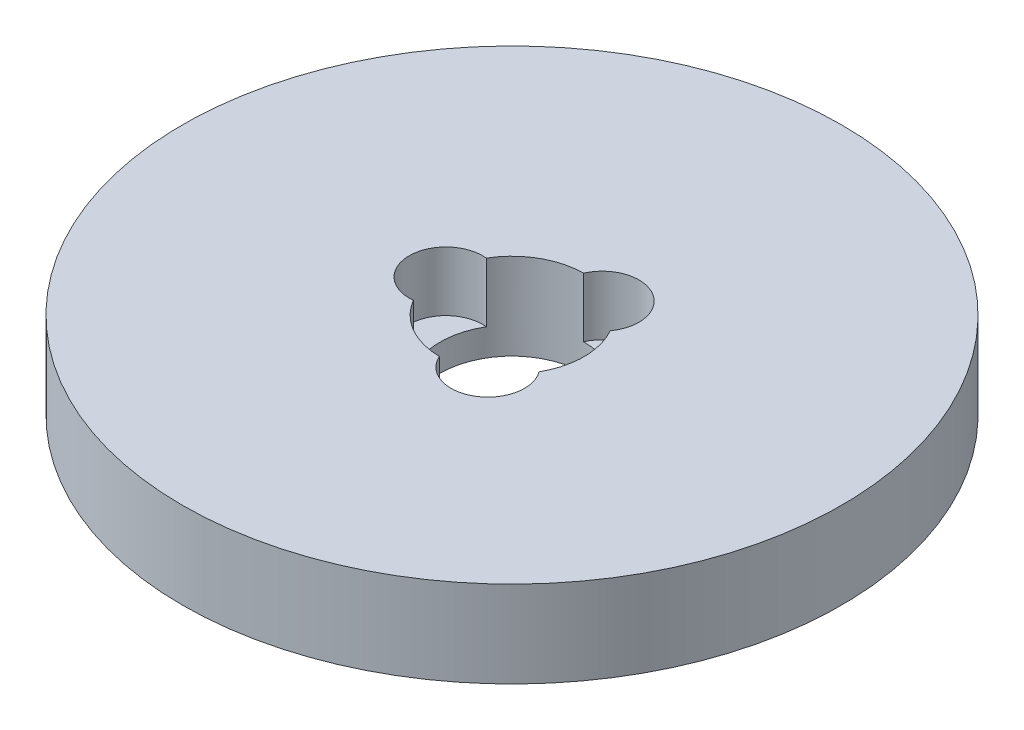
ISO-10303-21;
HEADER;
FILE_DESCRIPTION(('STEP AP214'),'2;1');
FILE_NAME('part.step','',(''),(''),'','','');
FILE_SCHEMA(('AUTOMOTIVE_DESIGN { 1 0 10303 214 1 1 1 1 }'));
ENDSEC;
DATA;
#1=APPLICATION_CONTEXT('core data for automotive mechanical design processes');
#2=APPLICATION_PROTOCOL_DEFINITION('international standard','automotive_design',2000,#1);
#3=PRODUCT_CONTEXT('',#1,'mechanical');
#4=PRODUCT('Part','Part','',(#3));
#5=PRODUCT_RELATED_PRODUCT_CATEGORY('part','',(#4));
#6=PRODUCT_DEFINITION_FORMATION('','',#4);
#7=PRODUCT_DEFINITION_CONTEXT('part definition',#1,'design');
#8=PRODUCT_DEFINITION('design','',#6,#7);
#9=PRODUCT_DEFINITION_SHAPE('','',#8);
#10=(LENGTH_UNIT() NAMED_UNIT(*) SI_UNIT(.MILLI.,.METRE.));
#11=(NAMED_UNIT(*) PLANE_ANGLE_UNIT() SI_UNIT($,.RADIAN.));
#12=(NAMED_UNIT(*) SI_UNIT($,.STERADIAN.) SOLID_ANGLE_UNIT());
#13=UNCERTAINTY_MEASURE_WITH_UNIT(LENGTH_MEASURE(1.E-05),#10,'distance_accuracy_value','');
#14=(GEOMETRIC_REPRESENTATION_CONTEXT(3) GLOBAL_UNCERTAINTY_ASSIGNED_CONTEXT((#13)) GLOBAL_UNIT_ASSIGNED_CONTEXT((#10,
#11,#12)) REPRESENTATION_CONTEXT('',''));
#15=CARTESIAN_POINT('',(0.,0.,0.));
#16=DIRECTION('',(0.,0.,1.));
#17=DIRECTION('',(1.,0.,0.));
#18=AXIS2_PLACEMENT_3D('',#15,#16,#17);
#19=CARTESIAN_POINT('',(0.,21.,0.));
#20=DIRECTION('',(0.,-1.,0.));
#21=DIRECTION('',(0.,0.,-1.));
#22=AXIS2_PLACEMENT_3D('',#19,#20,#21);
#23=CYLINDRICAL_SURFACE('',#22,80.);
#24=CARTESIAN_POINT('',(0.,21.,0.));
#25=DIRECTION('',(0.,1.,0.));
#26=DIRECTION('',(0.,0.,1.));
#27=AXIS2_PLACEMENT_3D('',#24,#25,#26);
#28=CIRCLE('',#27,80.);
#29=CARTESIAN_POINT('',(0.,21.,-80.));
#30=VERTEX_POINT('',#29);
#31=EDGE_CURVE('E126',#30,#30,#28,.T.);
#32=CARTESIAN_POINT('',(0.,0.,0.));
#33=DIRECTION('',(0.,1.,0.));
#34=DIRECTION('',(0.,0.,1.));
#35=AXIS2_PLACEMENT_3D('',#32,#33,#34);
#36=CIRCLE('',#35,80.);
#37=CARTESIAN_POINT('',(0.,0.,-80.));
#38=VERTEX_POINT('',#37);
#39=EDGE_CURVE('E124',#38,#38,#36,.T.);
#40=CARTESIAN_POINT('',(0.,21.,-80.));
#41=CARTESIAN_POINT('',(0.,20.78125,-80.));
#42=CARTESIAN_POINT('',(0.,20.5625,-80.));
#43=CARTESIAN_POINT('',(0.,20.125,-80.));
#44=CARTESIAN_POINT('',(0.,19.90625,-80.));
#45=CARTESIAN_POINT('',(0.,19.46875,-80.));
#46=CARTESIAN_POINT('',(0.,19.25,-80.));
#47=CARTESIAN_POINT('',(0.,18.8125,-80.));
#48=CARTESIAN_POINT('',(0.,18.59375,-80.));
#49=CARTESIAN_POINT('',(0.,18.15625,-80.));
#50=CARTESIAN_POINT('',(0.,17.9375,-80.));
#51=CARTESIAN_POINT('',(0.,17.5,-80.));
#52=CARTESIAN_POINT('',(0.,17.28125,-80.));
#53=CARTESIAN_POINT('',(0.,16.84375,-80.));
#54=CARTESIAN_POINT('',(0.,16.625,-80.));
#55=CARTESIAN_POINT('',(0.,16.1875,-80.));
#56=CARTESIAN_POINT('',(0.,15.96875,-80.));
#57=CARTESIAN_POINT('',(0.,15.53125,-80.));
#58=CARTESIAN_POINT('',(0.,15.3125,-80.));
#59=CARTESIAN_POINT('',(0.,14.875,-80.));
#60=CARTESIAN_POINT('',(0.,14.65625,-80.));
#61=CARTESIAN_POINT('',(0.,14.21875,-80.));
#62=CARTESIAN_POINT('',(0.,14.,-80.));
#63=CARTESIAN_POINT('',(0.,13.5625,-80.));
#64=CARTESIAN_POINT('',(0.,13.34375,-80.));
#65=CARTESIAN_POINT('',(0.,12.90625,-80.));
#66=CARTESIAN_POINT('',(0.,12.6875,-80.));
#67=CARTESIAN_POINT('',(0.,12.25,-80.));
#68=CARTESIAN_POINT('',(0.,12.03125,-80.));
#69=CARTESIAN_POINT('',(0.,11.59375,-80.));
#70=CARTESIAN_POINT('',(0.,11.375,-80.));
#71=CARTESIAN_POINT('',(0.,10.9375,-80.));
#72=CARTESIAN_POINT('',(0.,10.71875,-80.));
#73=CARTESIAN_POINT('',(0.,10.28125,-80.));
#74=CARTESIAN_POINT('',(0.,10.0625,-80.));
#75=CARTESIAN_POINT('',(0.,9.625,-80.));
#76=CARTESIAN_POINT('',(0.,9.40625,-80.));
#77=CARTESIAN_POINT('',(0.,8.96875,-80.));
#78=CARTESIAN_POINT('',(0.,8.75,-80.));
#79=CARTESIAN_POINT('',(0.,8.3125,-80.));
#80=CARTESIAN_POINT('',(0.,8.09375,-80.));
#81=CARTESIAN_POINT('',(0.,7.65625,-80.));
#82=CARTESIAN_POINT('',(0.,7.4375,-80.));
#83=CARTESIAN_POINT('',(0.,7.,-80.));
#84=CARTESIAN_POINT('',(0.,6.78125,-80.));
#85=CARTESIAN_POINT('',(0.,6.34375,-80.));
#86=CARTESIAN_POINT('',(0.,6.125,-80.));
#87=CARTESIAN_POINT('',(0.,5.6875,-80.));
#88=CARTESIAN_POINT('',(0.,5.46875,-80.));
#89=CARTESIAN_POINT('',(0.,5.03125,-80.));
#90=CARTESIAN_POINT('',(0.,4.8125,-80.));
#91=CARTESIAN_POINT('',(0.,4.375,-80.));
#92=CARTESIAN_POINT('',(0.,4.15625,-80.));
#93=CARTESIAN_POINT('',(0.,3.71875,-80.));
#94=CARTESIAN_POINT('',(0.,3.5,-80.));
#95=CARTESIAN_POINT('',(0.,3.0625,-80.));
#96=CARTESIAN_POINT('',(0.,2.84375,-80.));
#97=CARTESIAN_POINT('',(0.,2.40625,-80.));
#98=CARTESIAN_POINT('',(0.,2.1875,-80.));
#99=CARTESIAN_POINT('',(0.,1.75,-80.));
#100=CARTESIAN_POINT('',(0.,1.53125,-80.));
#101=CARTESIAN_POINT('',(0.,1.09375,-80.));
#102=CARTESIAN_POINT('',(0.,0.875000000000001,-80.));
#103=CARTESIAN_POINT('',(0.,0.4375,-80.));
#104=CARTESIAN_POINT('',(0.,0.21875,-80.));
#105=CARTESIAN_POINT('',(0.,0.,-80.));
#106=B_SPLINE_CURVE_WITH_KNOTS('',3,(#40,#41,#42,#43,#44,#45,#46,#47,#48,#49,#50,#51,#52,#53,
#54,#55,#56,#57,#58,#59,#60,#61,#62,#63,#64,#65,#66,#67,#68,#69,#70,#71,#72,#73,#74,#75,#76,#77,
#78,#79,#80,#81,#82,#83,#84,#85,#86,#87,#88,#89,#90,#91,#92,#93,#94,#95,#96,#97,#98,#99,#100,
#101,#102,#103,#104,#105),.UNSPECIFIED.,.F.,.F.,(4,2,2,2,2,2,2,2,2,2,2,2,2,2,2,2,2,2,2,2,2,2,2,
2,2,2,2,2,2,2,2,2,4),(0.,0.656250000000001,1.3125,1.96875,2.625,3.28125,3.9375,4.59375,5.25,
5.90625,6.5625,7.21875,7.875,8.53125,9.1875,9.84375,10.5,11.15625,11.8125,12.46875,13.125,
13.78125,14.4375,15.09375,15.75,16.40625,17.0625,17.71875,18.375,19.03125,19.6875,20.34375,21.),.UNSPECIFIED.);
#107=EDGE_CURVE('BSEAM39',#30,#38,#106,.T.);
#108=ORIENTED_EDGE('',*,*,#31,.F.);
#109=ORIENTED_EDGE('',*,*,#39,.T.);
#110=ORIENTED_EDGE('',*,*,#107,.T.);
#111=ORIENTED_EDGE('',*,*,#107,.F.);
#112=EDGE_LOOP('',(#108,#110,#109,#111));
#113=FACE_BOUND('',#112,.T.);
#114=ADVANCED_FACE('F39',(#113),#23,.T.);
#115=CARTESIAN_POINT('',(0.,21.,0.));
#116=DIRECTION('',(0.,1.,0.));
#117=DIRECTION('',(0.,0.,1.));
#118=AXIS2_PLACEMENT_3D('',#115,#116,#117);
#119=PLANE('',#118);
#120=CARTESIAN_POINT('',(8.02096647016177,21.,13.8927214521264));
#121=DIRECTION('',(0.,1.,0.));
#122=DIRECTION('',(0.866025403784436,0.,-0.500000000000004));
#123=AXIS2_PLACEMENT_3D('',#120,#121,#122);
#124=CIRCLE('',#123,8.91133143900656);
#125=CARTESIAN_POINT('',(-0.127820992930286,21.,17.4995331878815));
#126=VERTEX_POINT('',#125);
#127=CARTESIAN_POINT('',(15.2189507915395,21.,8.63907036692604));
#128=VERTEX_POINT('',#127);
#129=EDGE_CURVE('E147',#126,#128,#124,.T.);
#130=ORIENTED_EDGE('',*,*,#129,.F.);
#131=CARTESIAN_POINT('',(0.,21.,0.));
#132=DIRECTION('',(0.,1.,0.));
#133=DIRECTION('',(0.,0.,1.));
#134=AXIS2_PLACEMENT_3D('',#131,#132,#133);
#135=CIRCLE('',#134,17.5);
#136=CARTESIAN_POINT('',(-15.0911297986091,21.,8.8604628209554));
#137=VERTEX_POINT('',#136);
#138=EDGE_CURVE('E118',#137,#126,#135,.T.);
#139=ORIENTED_EDGE('',*,*,#138,.F.);
#140=CARTESIAN_POINT('',(-16.0419329403234,21.,0.));
#141=DIRECTION('',(0.,1.,0.));
#142=DIRECTION('',(0.,0.,1.));
#143=AXIS2_PLACEMENT_3D('',#140,#141,#142);
#144=CIRCLE('',#143,8.91133143900656);
#145=CARTESIAN_POINT('',(-15.0911297986091,21.,-8.8604628209554));
#146=VERTEX_POINT('',#145);
#147=EDGE_CURVE('E113',#146,#137,#144,.T.);
#148=ORIENTED_EDGE('',*,*,#147,.F.);
#149=CARTESIAN_POINT('',(-0.127820992930528,21.,-17.4995331878815));
#150=VERTEX_POINT('',#149);
#151=EDGE_CURVE('E106',#150,#146,#135,.T.);
#152=ORIENTED_EDGE('',*,*,#151,.F.);
#153=CARTESIAN_POINT('',(8.02096647016158,21.,-13.8927214521265));
#154=DIRECTION('',(0.,1.,0.));
#155=DIRECTION('',(-0.866025403784443,0.,-0.499999999999992));
#156=AXIS2_PLACEMENT_3D('',#153,#154,#155);
#157=CIRCLE('',#156,8.91133143900656);
#158=CARTESIAN_POINT('',(15.2189507915394,21.,-8.63907036692625));
#159=VERTEX_POINT('',#158);
#160=EDGE_CURVE('E90',#159,#150,#157,.T.);
#161=ORIENTED_EDGE('',*,*,#160,.F.);
#162=EDGE_CURVE('E116',#128,#159,#135,.T.);
#163=ORIENTED_EDGE('',*,*,#162,.F.);
#164=EDGE_LOOP('',(#130,#139,#148,#152,#161,#163));
#165=FACE_BOUND('',#164,.T.);
#166=ORIENTED_EDGE('',*,*,#31,.T.);
#167=EDGE_LOOP('',(#166));
#168=FACE_BOUND('',#167,.T.);
#169=ADVANCED_FACE('F115',(#165,#168),#119,.T.);
#170=CARTESIAN_POINT('',(0.,0.,0.));
#171=DIRECTION('',(0.,1.,0.));
#172=DIRECTION('',(0.,0.,1.));
#173=AXIS2_PLACEMENT_3D('',#170,#171,#172);
#174=PLANE('',#173);
#175=CARTESIAN_POINT('',(0.,0.,0.));
#176=DIRECTION('',(0.,1.,0.));
#177=DIRECTION('',(0.,0.,1.));
#178=AXIS2_PLACEMENT_3D('',#175,#176,#177);
#179=CIRCLE('',#178,17.5);
#180=CARTESIAN_POINT('',(0.,0.,17.5));
#181=VERTEX_POINT('',#180);
#182=EDGE_CURVE('E120',#181,#181,#179,.T.);
#183=ORIENTED_EDGE('',*,*,#182,.T.);
#184=EDGE_LOOP('',(#183));
#185=FACE_BOUND('',#184,.T.);
#186=ORIENTED_EDGE('',*,*,#39,.F.);
#187=EDGE_LOOP('',(#186));
#188=FACE_BOUND('',#187,.T.);
#189=ADVANCED_FACE('F164',(#185,#188),#174,.F.);
#190=CARTESIAN_POINT('',(0.,21.,0.));
#191=DIRECTION('',(0.,-1.,0.));
#192=DIRECTION('',(0.,0.,-1.));
#193=AXIS2_PLACEMENT_3D('',#190,#191,#192);
#194=CYLINDRICAL_SURFACE('',#193,17.5);
#195=DIRECTION('',(0.,1.,0.));
#196=VECTOR('',#195,1.);
#197=CARTESIAN_POINT('',(-0.127820992930284,13.7829980846651,17.4995331878815));
#198=LINE('',#197,#196);
#199=CARTESIAN_POINT('',(-0.127820992930286,6.56599616933015,17.4995331878815));
#200=VERTEX_POINT('',#199);
#201=EDGE_CURVE('E11',#200,#126,#198,.T.);
#202=ORIENTED_EDGE('',*,*,#201,.F.);
#203=CARTESIAN_POINT('',(0.,6.56599616933015,0.));
#204=DIRECTION('',(0.,1.,0.));
#205=DIRECTION('',(0.,0.,1.));
#206=AXIS2_PLACEMENT_3D('',#203,#204,#205);
#207=CIRCLE('',#206,17.5);
#208=CARTESIAN_POINT('',(15.2189507915395,6.56599616933015,8.63907036692604));
#209=VERTEX_POINT('',#208);
#210=EDGE_CURVE('E144',#200,#209,#207,.T.);
#211=ORIENTED_EDGE('',*,*,#210,.T.);
#212=DIRECTION('',(0.,1.,0.));
#213=VECTOR('',#212,1.);
#214=CARTESIAN_POINT('',(15.2189507915395,13.7829980846651,8.63907036692604));
#215=LINE('',#214,#213);
#216=EDGE_CURVE('E46',#128,#209,#215,.F.);
#217=ORIENTED_EDGE('',*,*,#216,.F.);
#218=ORIENTED_EDGE('',*,*,#162,.T.);
#219=DIRECTION('',(0.,1.,0.));
#220=VECTOR('',#219,1.);
#221=CARTESIAN_POINT('',(15.2189507915394,13.7829980846651,-8.63907036692625));
#222=LINE('',#221,#220);
#223=CARTESIAN_POINT('',(15.2189507915394,6.56599616933015,-8.63907036692625));
#224=VERTEX_POINT('',#223);
#225=EDGE_CURVE('E92',#224,#159,#222,.T.);
#226=ORIENTED_EDGE('',*,*,#225,.F.);
#227=CARTESIAN_POINT('',(0.,6.56599616933015,0.));
#228=DIRECTION('',(0.,1.,0.));
#229=DIRECTION('',(0.,0.,1.));
#230=AXIS2_PLACEMENT_3D('',#227,#228,#229);
#231=CIRCLE('',#230,17.5);
#232=CARTESIAN_POINT('',(-0.127820992930528,6.56599616933015,-17.4995331878815));
#233=VERTEX_POINT('',#232);
#234=EDGE_CURVE('E107',#224,#233,#231,.T.);
#235=ORIENTED_EDGE('',*,*,#234,.T.);
#236=DIRECTION('',(0.,1.,0.));
#237=VECTOR('',#236,1.);
#238=CARTESIAN_POINT('',(-0.127820992930527,13.7829980846651,-17.4995331878815));
#239=LINE('',#238,#237);
#240=EDGE_CURVE('E95',#150,#233,#239,.F.);
#241=ORIENTED_EDGE('',*,*,#240,.F.);
#242=ORIENTED_EDGE('',*,*,#151,.T.);
#243=DIRECTION('',(0.,1.,0.));
#244=VECTOR('',#243,1.);
#245=CARTESIAN_POINT('',(-15.0911297986091,13.7829980846651,-8.86046282095541));
#246=LINE('',#245,#244);
#247=CARTESIAN_POINT('',(-15.0911297986091,6.56599616933015,-8.8604628209554));
#248=VERTEX_POINT('',#247);
#249=EDGE_CURVE('E143',#248,#146,#246,.T.);
#250=ORIENTED_EDGE('',*,*,#249,.F.);
#251=CARTESIAN_POINT('',(0.,6.56599616933015,0.));
#252=DIRECTION('',(0.,1.,0.));
#253=DIRECTION('',(0.,0.,1.));
#254=AXIS2_PLACEMENT_3D('',#251,#252,#253);
#255=CIRCLE('',#254,17.5);
#256=CARTESIAN_POINT('',(-15.0911297986091,6.56599616933015,8.8604628209554));
#257=VERTEX_POINT('',#256);
#258=EDGE_CURVE('E132',#248,#257,#255,.T.);
#259=ORIENTED_EDGE('',*,*,#258,.T.);
#260=DIRECTION('',(0.,1.,0.));
#261=VECTOR('',#260,1.);
#262=CARTESIAN_POINT('',(-15.0911297986091,13.7829980846651,8.86046282095541));
#263=LINE('',#262,#261);
#264=EDGE_CURVE('E137',#137,#257,#263,.F.);
#265=ORIENTED_EDGE('',*,*,#264,.F.);
#266=ORIENTED_EDGE('',*,*,#138,.T.);
#267=EDGE_LOOP('',(#202,#211,#217,#218,#226,#235,#241,#242,#250,#259,#265,#266));
#268=FACE_BOUND('',#267,.T.);
#269=ORIENTED_EDGE('',*,*,#182,.F.);
#270=EDGE_LOOP('',(#269));
#271=FACE_BOUND('',#270,.T.);
#272=ADVANCED_FACE('F103',(#268,#271),#194,.F.);
#273=CARTESIAN_POINT('',(-16.0419329403234,6.56599616933015,0.));
#274=DIRECTION('',(0.,1.,0.));
#275=DIRECTION('',(0.,0.,1.));
#276=AXIS2_PLACEMENT_3D('',#273,#274,#275);
#277=CYLINDRICAL_SURFACE('',#276,8.91133143900656);
#278=ORIENTED_EDGE('',*,*,#249,.T.);
#279=ORIENTED_EDGE('',*,*,#147,.T.);
#280=ORIENTED_EDGE('',*,*,#264,.T.);
#281=CARTESIAN_POINT('',(-16.0419329403234,6.56599616933015,0.));
#282=DIRECTION('',(0.,1.,0.));
#283=DIRECTION('',(0.,0.,1.));
#284=AXIS2_PLACEMENT_3D('',#281,#282,#283);
#285=CIRCLE('',#284,8.91133143900656);
#286=EDGE_CURVE('E121',#248,#257,#285,.T.);
#287=ORIENTED_EDGE('',*,*,#286,.F.);
#288=EDGE_LOOP('',(#278,#279,#280,#287));
#289=FACE_BOUND('',#288,.T.);
#290=ADVANCED_FACE('F174',(#289),#277,.F.);
#291=CARTESIAN_POINT('',(-16.0419329403234,6.56599616933015,0.));
#292=DIRECTION('',(0.,1.,0.));
#293=DIRECTION('',(0.,0.,1.));
#294=AXIS2_PLACEMENT_3D('',#291,#292,#293);
#295=PLANE('',#294);
#296=ORIENTED_EDGE('',*,*,#286,.T.);
#297=ORIENTED_EDGE('',*,*,#258,.F.);
#298=EDGE_LOOP('',(#296,#297));
#299=FACE_BOUND('',#298,.T.);
#300=ADVANCED_FACE('F177',(#299),#295,.T.);
#301=CARTESIAN_POINT('',(8.02096647016158,6.56599616933015,-13.8927214521265));
#302=DIRECTION('',(0.,1.,0.));
#303=DIRECTION('',(0.,0.,1.));
#304=AXIS2_PLACEMENT_3D('',#301,#302,#303);
#305=CYLINDRICAL_SURFACE('',#304,8.91133143900656);
#306=ORIENTED_EDGE('',*,*,#225,.T.);
#307=ORIENTED_EDGE('',*,*,#160,.T.);
#308=ORIENTED_EDGE('',*,*,#240,.T.);
#309=CARTESIAN_POINT('',(8.02096647016158,6.56599616933015,-13.8927214521265));
#310=DIRECTION('',(0.,1.,0.));
#311=DIRECTION('',(-0.866025403784443,0.,-0.499999999999992));
#312=AXIS2_PLACEMENT_3D('',#309,#310,#311);
#313=CIRCLE('',#312,8.91133143900656);
#314=EDGE_CURVE('E56',#224,#233,#313,.T.);
#315=ORIENTED_EDGE('',*,*,#314,.F.);
#316=EDGE_LOOP('',(#306,#307,#308,#315));
#317=FACE_BOUND('',#316,.T.);
#318=ADVANCED_FACE('F93',(#317),#305,.F.);
#319=CARTESIAN_POINT('',(8.02096647016158,6.56599616933015,-13.8927214521265));
#320=DIRECTION('',(0.,1.,0.));
#321=DIRECTION('',(-0.866025403784443,0.,-0.499999999999992));
#322=AXIS2_PLACEMENT_3D('',#319,#320,#321);
#323=PLANE('',#322);
#324=ORIENTED_EDGE('',*,*,#314,.T.);
#325=ORIENTED_EDGE('',*,*,#234,.F.);
#326=EDGE_LOOP('',(#324,#325));
#327=FACE_BOUND('',#326,.T.);
#328=ADVANCED_FACE('F160',(#327),#323,.T.);
#329=CARTESIAN_POINT('',(8.02096647016177,6.56599616933015,13.8927214521264));
#330=DIRECTION('',(0.,1.,0.));
#331=DIRECTION('',(0.,0.,1.));
#332=AXIS2_PLACEMENT_3D('',#329,#330,#331);
#333=CYLINDRICAL_SURFACE('',#332,8.91133143900656);
#334=ORIENTED_EDGE('',*,*,#201,.T.);
#335=ORIENTED_EDGE('',*,*,#129,.T.);
#336=ORIENTED_EDGE('',*,*,#216,.T.);
#337=CARTESIAN_POINT('',(8.02096647016177,6.56599616933015,13.8927214521264));
#338=DIRECTION('',(0.,1.,0.));
#339=DIRECTION('',(0.866025403784436,0.,-0.500000000000004));
#340=AXIS2_PLACEMENT_3D('',#337,#338,#339);
#341=CIRCLE('',#340,8.91133143900656);
#342=EDGE_CURVE('E55',#200,#209,#341,.T.);
#343=ORIENTED_EDGE('',*,*,#342,.F.);
#344=EDGE_LOOP('',(#334,#335,#336,#343));
#345=FACE_BOUND('',#344,.T.);
#346=ADVANCED_FACE('F149',(#345),#333,.F.);
#347=CARTESIAN_POINT('',(8.02096647016177,6.56599616933015,13.8927214521264));
#348=DIRECTION('',(0.,1.,0.));
#349=DIRECTION('',(0.866025403784436,0.,-0.500000000000004));
#350=AXIS2_PLACEMENT_3D('',#347,#348,#349);
#351=PLANE('',#350);
#352=ORIENTED_EDGE('',*,*,#342,.T.);
#353=ORIENTED_EDGE('',*,*,#210,.F.);
#354=EDGE_LOOP('',(#352,#353));
#355=FACE_BOUND('',#354,.T.);
#356=ADVANCED_FACE('F151',(#355),#351,.T.);
#357=CLOSED_SHELL('',(#114,#169,#189,#272,#290,#300,#318,#328,#346,#356));
#358=MANIFOLD_SOLID_BREP('B2',#357);
#359=ADVANCED_BREP_SHAPE_REPRESENTATION('',(#18,#358),#14);
#360=SHAPE_DEFINITION_REPRESENTATION(#9,#359);
ENDSEC;
END-ISO-10303-21;
